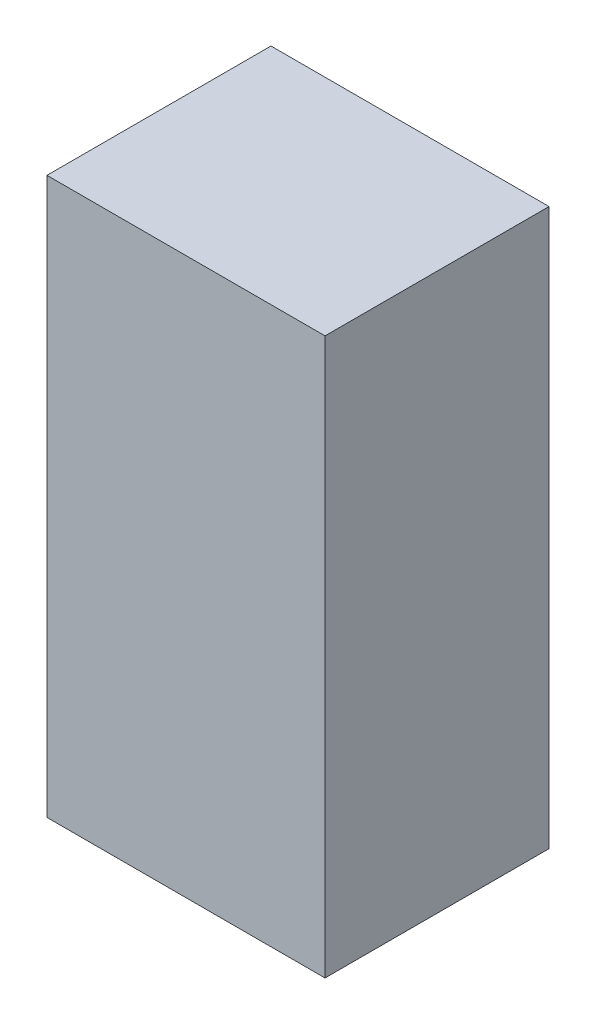
ISO-10303-21;
HEADER;
FILE_DESCRIPTION(('STEP AP214'),'2;1');
FILE_NAME('part.step','',(''),(''),'','','');
FILE_SCHEMA(('AUTOMOTIVE_DESIGN { 1 0 10303 214 1 1 1 1 }'));
ENDSEC;
DATA;
#1=APPLICATION_CONTEXT('core data for automotive mechanical design processes');
#2=APPLICATION_PROTOCOL_DEFINITION('international standard','automotive_design',2000,#1);
#3=PRODUCT_CONTEXT('',#1,'mechanical');
#4=PRODUCT('Part','Part','',(#3));
#5=PRODUCT_RELATED_PRODUCT_CATEGORY('part','',(#4));
#6=PRODUCT_DEFINITION_FORMATION('','',#4);
#7=PRODUCT_DEFINITION_CONTEXT('part definition',#1,'design');
#8=PRODUCT_DEFINITION('design','',#6,#7);
#9=PRODUCT_DEFINITION_SHAPE('','',#8);
#10=(LENGTH_UNIT() NAMED_UNIT(*) SI_UNIT(.MILLI.,.METRE.));
#11=(NAMED_UNIT(*) PLANE_ANGLE_UNIT() SI_UNIT($,.RADIAN.));
#12=(NAMED_UNIT(*) SI_UNIT($,.STERADIAN.) SOLID_ANGLE_UNIT());
#13=UNCERTAINTY_MEASURE_WITH_UNIT(LENGTH_MEASURE(1.E-05),#10,'distance_accuracy_value','');
#14=(GEOMETRIC_REPRESENTATION_CONTEXT(3) GLOBAL_UNCERTAINTY_ASSIGNED_CONTEXT((#13)) GLOBAL_UNIT_ASSIGNED_CONTEXT((#10,
#11,#12)) REPRESENTATION_CONTEXT('',''));
#15=CARTESIAN_POINT('',(0.,0.,0.));
#16=DIRECTION('',(0.,0.,1.));
#17=DIRECTION('',(1.,0.,0.));
#18=AXIS2_PLACEMENT_3D('',#15,#16,#17);
#19=CARTESIAN_POINT('',(18.,72.,-14.5));
#20=DIRECTION('',(-1.,0.,0.));
#21=DIRECTION('',(0.,0.,1.));
#22=AXIS2_PLACEMENT_3D('',#19,#20,#21);
#23=PLANE('',#22);
#24=DIRECTION('',(0.,0.,-1.));
#25=VECTOR('',#24,1.);
#26=CARTESIAN_POINT('',(18.,0.,-14.5));
#27=LINE('',#26,#25);
#28=CARTESIAN_POINT('',(18.,0.,14.5));
#29=VERTEX_POINT('',#28);
#30=CARTESIAN_POINT('',(18.,0.,-14.5));
#31=VERTEX_POINT('',#30);
#32=EDGE_CURVE('E107',#29,#31,#27,.T.);
#33=ORIENTED_EDGE('',*,*,#32,.T.);
#34=DIRECTION('',(0.,-1.,0.));
#35=VECTOR('',#34,1.);
#36=CARTESIAN_POINT('',(18.,72.,-14.5));
#37=LINE('',#36,#35);
#38=CARTESIAN_POINT('',(18.,72.,-14.5));
#39=VERTEX_POINT('',#38);
#40=EDGE_CURVE('E11',#39,#31,#37,.T.);
#41=ORIENTED_EDGE('',*,*,#40,.F.);
#42=DIRECTION('',(0.,0.,-1.));
#43=VECTOR('',#42,1.);
#44=CARTESIAN_POINT('',(18.,72.,-14.5));
#45=LINE('',#44,#43);
#46=CARTESIAN_POINT('',(18.,72.,14.5));
#47=VERTEX_POINT('',#46);
#48=EDGE_CURVE('E91',#47,#39,#45,.T.);
#49=ORIENTED_EDGE('',*,*,#48,.F.);
#50=DIRECTION('',(0.,-1.,0.));
#51=VECTOR('',#50,1.);
#52=CARTESIAN_POINT('',(18.,72.,14.5));
#53=LINE('',#52,#51);
#54=EDGE_CURVE('E103',#47,#29,#53,.T.);
#55=ORIENTED_EDGE('',*,*,#54,.T.);
#56=EDGE_LOOP('',(#33,#41,#49,#55));
#57=FACE_BOUND('',#56,.T.);
#58=ADVANCED_FACE('F39',(#57),#23,.F.);
#59=CARTESIAN_POINT('',(-18.,72.,-14.5));
#60=DIRECTION('',(0.,0.,1.));
#61=DIRECTION('',(1.,0.,0.));
#62=AXIS2_PLACEMENT_3D('',#59,#60,#61);
#63=PLANE('',#62);
#64=DIRECTION('',(-1.,0.,0.));
#65=VECTOR('',#64,1.);
#66=CARTESIAN_POINT('',(-18.,0.,-14.5));
#67=LINE('',#66,#65);
#68=CARTESIAN_POINT('',(-18.,0.,-14.5));
#69=VERTEX_POINT('',#68);
#70=EDGE_CURVE('E96',#31,#69,#67,.T.);
#71=ORIENTED_EDGE('',*,*,#70,.T.);
#72=DIRECTION('',(0.,-1.,0.));
#73=VECTOR('',#72,1.);
#74=CARTESIAN_POINT('',(-18.,72.,-14.5));
#75=LINE('',#74,#73);
#76=CARTESIAN_POINT('',(-18.,72.,-14.5));
#77=VERTEX_POINT('',#76);
#78=EDGE_CURVE('E48',#77,#69,#75,.T.);
#79=ORIENTED_EDGE('',*,*,#78,.F.);
#80=DIRECTION('',(-1.,0.,0.));
#81=VECTOR('',#80,1.);
#82=CARTESIAN_POINT('',(-18.,72.,-14.5));
#83=LINE('',#82,#81);
#84=EDGE_CURVE('E86',#39,#77,#83,.T.);
#85=ORIENTED_EDGE('',*,*,#84,.F.);
#86=ORIENTED_EDGE('',*,*,#40,.T.);
#87=EDGE_LOOP('',(#71,#79,#85,#86));
#88=FACE_BOUND('',#87,.T.);
#89=ADVANCED_FACE('F95',(#88),#63,.F.);
#90=CARTESIAN_POINT('',(-18.,72.,-14.5));
#91=DIRECTION('',(1.,0.,0.));
#92=DIRECTION('',(0.,0.,-1.));
#93=AXIS2_PLACEMENT_3D('',#90,#91,#92);
#94=PLANE('',#93);
#95=DIRECTION('',(0.,0.,1.));
#96=VECTOR('',#95,1.);
#97=CARTESIAN_POINT('',(-18.,0.,-14.5));
#98=LINE('',#97,#96);
#99=CARTESIAN_POINT('',(-18.,0.,14.5));
#100=VERTEX_POINT('',#99);
#101=EDGE_CURVE('E73',#69,#100,#98,.T.);
#102=ORIENTED_EDGE('',*,*,#101,.T.);
#103=DIRECTION('',(0.,-1.,0.));
#104=VECTOR('',#103,1.);
#105=CARTESIAN_POINT('',(-18.,72.,14.5));
#106=LINE('',#105,#104);
#107=CARTESIAN_POINT('',(-18.,72.,14.5));
#108=VERTEX_POINT('',#107);
#109=EDGE_CURVE('E98',#108,#100,#106,.T.);
#110=ORIENTED_EDGE('',*,*,#109,.F.);
#111=DIRECTION('',(0.,0.,1.));
#112=VECTOR('',#111,1.);
#113=CARTESIAN_POINT('',(-18.,72.,-14.5));
#114=LINE('',#113,#112);
#115=EDGE_CURVE('E89',#77,#108,#114,.T.);
#116=ORIENTED_EDGE('',*,*,#115,.F.);
#117=ORIENTED_EDGE('',*,*,#78,.T.);
#118=EDGE_LOOP('',(#102,#110,#116,#117));
#119=FACE_BOUND('',#118,.T.);
#120=ADVANCED_FACE('F99',(#119),#94,.F.);
#121=CARTESIAN_POINT('',(-18.,72.,14.5));
#122=DIRECTION('',(0.,0.,-1.));
#123=DIRECTION('',(-1.,0.,0.));
#124=AXIS2_PLACEMENT_3D('',#121,#122,#123);
#125=PLANE('',#124);
#126=DIRECTION('',(1.,0.,0.));
#127=VECTOR('',#126,1.);
#128=CARTESIAN_POINT('',(-18.,0.,14.5));
#129=LINE('',#128,#127);
#130=EDGE_CURVE('E79',#100,#29,#129,.T.);
#131=ORIENTED_EDGE('',*,*,#130,.T.);
#132=ORIENTED_EDGE('',*,*,#54,.F.);
#133=DIRECTION('',(1.,0.,0.));
#134=VECTOR('',#133,1.);
#135=CARTESIAN_POINT('',(-18.,72.,14.5));
#136=LINE('',#135,#134);
#137=EDGE_CURVE('E56',#108,#47,#136,.T.);
#138=ORIENTED_EDGE('',*,*,#137,.F.);
#139=ORIENTED_EDGE('',*,*,#109,.T.);
#140=EDGE_LOOP('',(#131,#132,#138,#139));
#141=FACE_BOUND('',#140,.T.);
#142=ADVANCED_FACE('F120',(#141),#125,.F.);
#143=CARTESIAN_POINT('',(0.,72.,0.));
#144=DIRECTION('',(0.,1.,0.));
#145=DIRECTION('',(0.,0.,1.));
#146=AXIS2_PLACEMENT_3D('',#143,#144,#145);
#147=PLANE('',#146);
#148=ORIENTED_EDGE('',*,*,#48,.T.);
#149=ORIENTED_EDGE('',*,*,#84,.T.);
#150=ORIENTED_EDGE('',*,*,#115,.T.);
#151=ORIENTED_EDGE('',*,*,#137,.T.);
#152=EDGE_LOOP('',(#148,#149,#150,#151));
#153=FACE_BOUND('',#152,.T.);
#154=ADVANCED_FACE('F87',(#153),#147,.T.);
#155=CARTESIAN_POINT('',(0.,0.,0.));
#156=DIRECTION('',(0.,1.,0.));
#157=DIRECTION('',(0.,0.,1.));
#158=AXIS2_PLACEMENT_3D('',#155,#156,#157);
#159=PLANE('',#158);
#160=ORIENTED_EDGE('',*,*,#32,.F.);
#161=ORIENTED_EDGE('',*,*,#130,.F.);
#162=ORIENTED_EDGE('',*,*,#101,.F.);
#163=ORIENTED_EDGE('',*,*,#70,.F.);
#164=EDGE_LOOP('',(#160,#161,#162,#163));
#165=FACE_BOUND('',#164,.T.);
#166=ADVANCED_FACE('F123',(#165),#159,.F.);
#167=CLOSED_SHELL('',(#58,#89,#120,#142,#154,#166));
#168=MANIFOLD_SOLID_BREP('B2',#167);
#169=ADVANCED_BREP_SHAPE_REPRESENTATION('',(#18,#168),#14);
#170=SHAPE_DEFINITION_REPRESENTATION(#9,#169);
ENDSEC;
END-ISO-10303-21;
